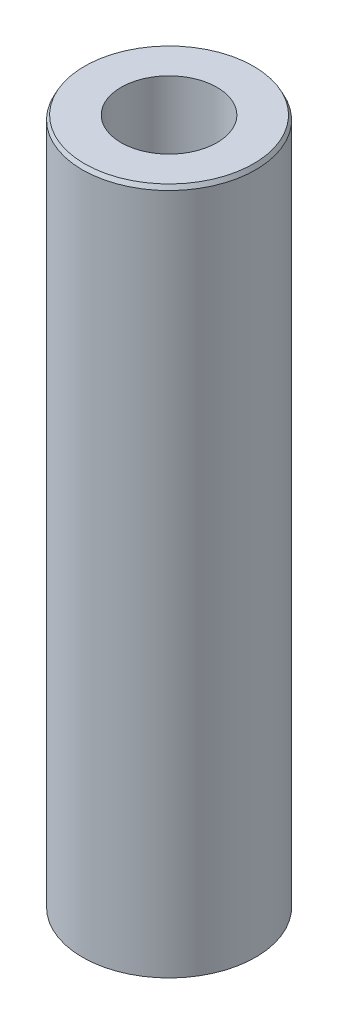
ISO-10303-21;
HEADER;
FILE_DESCRIPTION(('STEP AP214'),'2;1');
FILE_NAME('part.step','',(''),(''),'','','');
FILE_SCHEMA(('AUTOMOTIVE_DESIGN { 1 0 10303 214 1 1 1 1 }'));
ENDSEC;
DATA;
#1=APPLICATION_CONTEXT('core data for automotive mechanical design processes');
#2=APPLICATION_PROTOCOL_DEFINITION('international standard','automotive_design',2000,#1);
#3=PRODUCT_CONTEXT('',#1,'mechanical');
#4=PRODUCT('Part','Part','',(#3));
#5=PRODUCT_RELATED_PRODUCT_CATEGORY('part','',(#4));
#6=PRODUCT_DEFINITION_FORMATION('','',#4);
#7=PRODUCT_DEFINITION_CONTEXT('part definition',#1,'design');
#8=PRODUCT_DEFINITION('design','',#6,#7);
#9=PRODUCT_DEFINITION_SHAPE('','',#8);
#10=(LENGTH_UNIT() NAMED_UNIT(*) SI_UNIT(.MILLI.,.METRE.));
#11=(NAMED_UNIT(*) PLANE_ANGLE_UNIT() SI_UNIT($,.RADIAN.));
#12=(NAMED_UNIT(*) SI_UNIT($,.STERADIAN.) SOLID_ANGLE_UNIT());
#13=UNCERTAINTY_MEASURE_WITH_UNIT(LENGTH_MEASURE(1.E-05),#10,'distance_accuracy_value','');
#14=(GEOMETRIC_REPRESENTATION_CONTEXT(3) GLOBAL_UNCERTAINTY_ASSIGNED_CONTEXT((#13)) GLOBAL_UNIT_ASSIGNED_CONTEXT((#10,
#11,#12)) REPRESENTATION_CONTEXT('',''));
#15=CARTESIAN_POINT('',(0.,0.,0.));
#16=DIRECTION('',(0.,0.,1.));
#17=DIRECTION('',(1.,0.,0.));
#18=AXIS2_PLACEMENT_3D('',#15,#16,#17);
#19=CARTESIAN_POINT('',(0.,297.808013692418,0.));
#20=DIRECTION('',(0.,-1.,0.));
#21=DIRECTION('',(0.,0.,-1.));
#22=AXIS2_PLACEMENT_3D('',#19,#20,#21);
#23=CYLINDRICAL_SURFACE('',#22,37.5);
#24=CARTESIAN_POINT('',(0.,295.997157857481,0.));
#25=DIRECTION('',(0.,1.,0.));
#26=DIRECTION('',(0.,0.,1.));
#27=AXIS2_PLACEMENT_3D('',#24,#25,#26);
#28=CIRCLE('',#27,37.5);
#29=CARTESIAN_POINT('',(0.,295.997157857481,37.5));
#30=VERTEX_POINT('',#29);
#31=EDGE_CURVE('E50',#30,#30,#28,.F.);
#32=ORIENTED_EDGE('',*,*,#31,.T.);
#33=EDGE_LOOP('',(#32));
#34=FACE_BOUND('',#33,.T.);
#35=CARTESIAN_POINT('',(0.,0.932475156476986,0.));
#36=DIRECTION('',(0.,1.,0.));
#37=DIRECTION('',(0.,0.,1.));
#38=AXIS2_PLACEMENT_3D('',#35,#36,#37);
#39=CIRCLE('',#38,37.5);
#40=CARTESIAN_POINT('',(0.,0.932475156476986,37.5));
#41=VERTEX_POINT('',#40);
#42=EDGE_CURVE('E51',#41,#41,#39,.T.);
#43=ORIENTED_EDGE('',*,*,#42,.T.);
#44=EDGE_LOOP('',(#43));
#45=FACE_BOUND('',#44,.T.);
#46=ADVANCED_FACE('F39',(#34,#45),#23,.T.);
#47=CARTESIAN_POINT('',(0.,297.808013692418,0.));
#48=DIRECTION('',(0.,1.,0.));
#49=DIRECTION('',(0.,0.,1.));
#50=AXIS2_PLACEMENT_3D('',#47,#48,#49);
#51=PLANE('',#50);
#52=CARTESIAN_POINT('',(0.,297.808013692418,0.));
#53=DIRECTION('',(0.,1.,0.));
#54=DIRECTION('',(0.,0.,1.));
#55=AXIS2_PLACEMENT_3D('',#52,#53,#54);
#56=CIRCLE('',#55,36.567524843523);
#57=CARTESIAN_POINT('',(0.,297.808013692418,36.567524843523));
#58=VERTEX_POINT('',#57);
#59=EDGE_CURVE('E54',#58,#58,#56,.T.);
#60=ORIENTED_EDGE('',*,*,#59,.T.);
#61=EDGE_LOOP('',(#60));
#62=FACE_BOUND('',#61,.T.);
#63=CARTESIAN_POINT('',(0.,297.808013692418,0.));
#64=DIRECTION('',(0.,1.,0.));
#65=DIRECTION('',(0.,0.,1.));
#66=AXIS2_PLACEMENT_3D('',#63,#64,#65);
#67=CIRCLE('',#66,20.764392845648);
#68=CARTESIAN_POINT('',(0.,297.808013692418,20.764392845648));
#69=VERTEX_POINT('',#68);
#70=EDGE_CURVE('E58',#69,#69,#67,.T.);
#71=ORIENTED_EDGE('',*,*,#70,.F.);
#72=EDGE_LOOP('',(#71));
#73=FACE_BOUND('',#72,.T.);
#74=ADVANCED_FACE('F69',(#62,#73),#51,.T.);
#75=CARTESIAN_POINT('',(0.,0.,0.));
#76=DIRECTION('',(0.,1.,0.));
#77=DIRECTION('',(0.,0.,1.));
#78=AXIS2_PLACEMENT_3D('',#75,#76,#77);
#79=PLANE('',#78);
#80=CARTESIAN_POINT('',(0.,0.,0.));
#81=DIRECTION('',(0.,1.,0.));
#82=DIRECTION('',(0.,0.,1.));
#83=AXIS2_PLACEMENT_3D('',#80,#81,#82);
#84=CIRCLE('',#83,35.6891441650636);
#85=CARTESIAN_POINT('',(0.,0.,35.6891441650636));
#86=VERTEX_POINT('',#85);
#87=EDGE_CURVE('E10',#86,#86,#84,.F.);
#88=ORIENTED_EDGE('',*,*,#87,.T.);
#89=EDGE_LOOP('',(#88));
#90=FACE_BOUND('',#89,.T.);
#91=CARTESIAN_POINT('',(0.,0.,0.));
#92=DIRECTION('',(0.,1.,0.));
#93=DIRECTION('',(0.,0.,1.));
#94=AXIS2_PLACEMENT_3D('',#91,#92,#93);
#95=CIRCLE('',#94,20.764392845648);
#96=CARTESIAN_POINT('',(0.,0.,20.764392845648));
#97=VERTEX_POINT('',#96);
#98=EDGE_CURVE('E63',#97,#97,#95,.T.);
#99=ORIENTED_EDGE('',*,*,#98,.T.);
#100=EDGE_LOOP('',(#99));
#101=FACE_BOUND('',#100,.T.);
#102=ADVANCED_FACE('F75',(#90,#101),#79,.F.);
#103=CARTESIAN_POINT('',(0.,297.808013692418,0.));
#104=DIRECTION('',(0.,-1.,0.));
#105=DIRECTION('',(0.,0.,-1.));
#106=AXIS2_PLACEMENT_3D('',#103,#104,#105);
#107=CYLINDRICAL_SURFACE('',#106,20.764392845648);
#108=ORIENTED_EDGE('',*,*,#70,.T.);
#109=EDGE_LOOP('',(#108));
#110=FACE_BOUND('',#109,.T.);
#111=ORIENTED_EDGE('',*,*,#98,.F.);
#112=EDGE_LOOP('',(#111));
#113=FACE_BOUND('',#112,.T.);
#114=ADVANCED_FACE('F70',(#110,#113),#107,.F.);
#115=CARTESIAN_POINT('',(0.,297.808013692418,0.));
#116=DIRECTION('',(0.,-1.,0.));
#117=DIRECTION('',(0.,0.,-1.));
#118=AXIS2_PLACEMENT_3D('',#115,#116,#117);
#119=CONICAL_SURFACE('',#118,36.567524843523,0.475525016824135);
#120=ORIENTED_EDGE('',*,*,#31,.F.);
#121=EDGE_LOOP('',(#120));
#122=FACE_BOUND('',#121,.T.);
#123=ORIENTED_EDGE('',*,*,#59,.F.);
#124=EDGE_LOOP('',(#123));
#125=FACE_BOUND('',#124,.T.);
#126=ADVANCED_FACE('F81',(#122,#125),#119,.T.);
#127=CARTESIAN_POINT('',(0.,0.932475156476986,0.));
#128=DIRECTION('',(0.,1.,0.));
#129=DIRECTION('',(0.,0.,1.));
#130=AXIS2_PLACEMENT_3D('',#127,#128,#129);
#131=CONICAL_SURFACE('',#130,37.5,1.09527130997077);
#132=ORIENTED_EDGE('',*,*,#87,.F.);
#133=EDGE_LOOP('',(#132));
#134=FACE_BOUND('',#133,.T.);
#135=ORIENTED_EDGE('',*,*,#42,.F.);
#136=EDGE_LOOP('',(#135));
#137=FACE_BOUND('',#136,.T.);
#138=ADVANCED_FACE('F45',(#134,#137),#131,.T.);
#139=CLOSED_SHELL('',(#46,#74,#102,#114,#126,#138));
#140=MANIFOLD_SOLID_BREP('B2',#139);
#141=ADVANCED_BREP_SHAPE_REPRESENTATION('',(#18,#140),#14);
#142=SHAPE_DEFINITION_REPRESENTATION(#9,#141);
ENDSEC;
END-ISO-10303-21;
